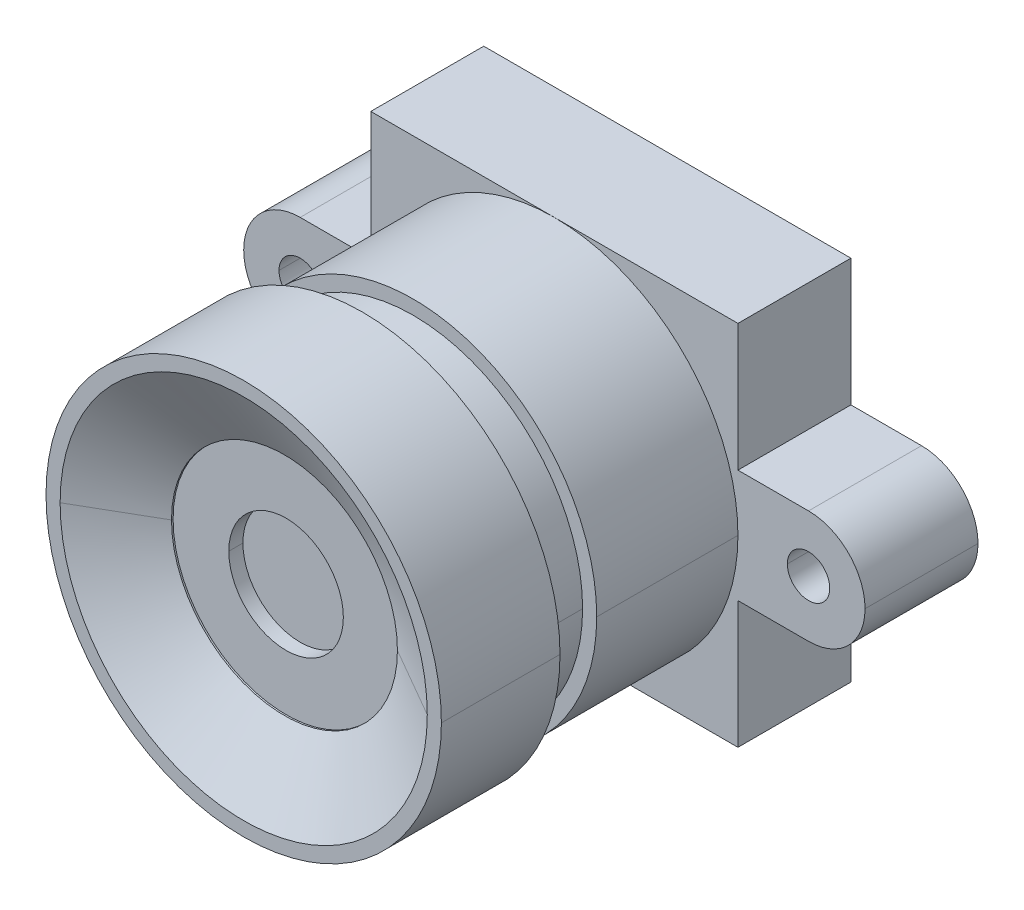
ISO-10303-21;
HEADER;
FILE_DESCRIPTION(('STEP AP214'),'2;1');
FILE_NAME('part.step','',(''),(''),'','','');
FILE_SCHEMA(('AUTOMOTIVE_DESIGN { 1 0 10303 214 1 1 1 1 }'));
ENDSEC;
DATA;
#1=APPLICATION_CONTEXT('core data for automotive mechanical design processes');
#2=APPLICATION_PROTOCOL_DEFINITION('international standard','automotive_design',2000,#1);
#3=PRODUCT_CONTEXT('',#1,'mechanical');
#4=PRODUCT('Part','Part','',(#3));
#5=PRODUCT_RELATED_PRODUCT_CATEGORY('part','',(#4));
#6=PRODUCT_DEFINITION_FORMATION('','',#4);
#7=PRODUCT_DEFINITION_CONTEXT('part definition',#1,'design');
#8=PRODUCT_DEFINITION('design','',#6,#7);
#9=PRODUCT_DEFINITION_SHAPE('','',#8);
#10=(LENGTH_UNIT() NAMED_UNIT(*) SI_UNIT(.MILLI.,.METRE.));
#11=(NAMED_UNIT(*) PLANE_ANGLE_UNIT() SI_UNIT($,.RADIAN.));
#12=(NAMED_UNIT(*) SI_UNIT($,.STERADIAN.) SOLID_ANGLE_UNIT());
#13=UNCERTAINTY_MEASURE_WITH_UNIT(LENGTH_MEASURE(1.E-05),#10,'distance_accuracy_value','');
#14=(GEOMETRIC_REPRESENTATION_CONTEXT(3) GLOBAL_UNCERTAINTY_ASSIGNED_CONTEXT((#13)) GLOBAL_UNIT_ASSIGNED_CONTEXT((#10,
#11,#12)) REPRESENTATION_CONTEXT('',''));
#15=CARTESIAN_POINT('',(0.,0.,0.));
#16=DIRECTION('',(0.,0.,1.));
#17=DIRECTION('',(1.,0.,0.));
#18=AXIS2_PLACEMENT_3D('',#15,#16,#17);
#19=CARTESIAN_POINT('',(0.,0.,13.));
#20=DIRECTION('',(0.,0.,1.));
#21=DIRECTION('',(1.,0.,0.));
#22=AXIS2_PLACEMENT_3D('',#19,#20,#21);
#23=PLANE('',#22);
#24=CARTESIAN_POINT('',(0.,0.,13.));
#25=DIRECTION('',(0.,0.,1.));
#26=DIRECTION('',(1.,0.,0.));
#27=AXIS2_PLACEMENT_3D('',#24,#25,#26);
#28=CIRCLE('',#27,2.02791290993503);
#29=CARTESIAN_POINT('',(2.02791290993503,0.,13.));
#30=VERTEX_POINT('',#29);
#31=CARTESIAN_POINT('',(-2.02791290993503,0.,13.));
#32=VERTEX_POINT('',#31);
#33=EDGE_CURVE('E11',#30,#32,#28,.T.);
#34=ORIENTED_EDGE('',*,*,#33,.T.);
#35=CARTESIAN_POINT('',(0.,0.,13.));
#36=DIRECTION('',(0.,0.,1.));
#37=DIRECTION('',(1.,0.,0.));
#38=AXIS2_PLACEMENT_3D('',#35,#36,#37);
#39=CIRCLE('',#38,2.02791290993503);
#40=EDGE_CURVE('E264',#32,#30,#39,.T.);
#41=ORIENTED_EDGE('',*,*,#40,.T.);
#42=EDGE_LOOP('',(#34,#41));
#43=FACE_BOUND('',#42,.T.);
#44=ADVANCED_FACE('F48',(#43),#23,.T.);
#45=CARTESIAN_POINT('',(0.,0.,13.));
#46=DIRECTION('',(0.,0.,1.));
#47=DIRECTION('',(1.,0.,0.));
#48=AXIS2_PLACEMENT_3D('',#45,#46,#47);
#49=CYLINDRICAL_SURFACE('',#48,2.02791290993503);
#50=DIRECTION('',(0.,0.,1.));
#51=VECTOR('',#50,1.);
#52=CARTESIAN_POINT('',(-2.02791290993503,0.,13.));
#53=LINE('',#52,#51);
#54=CARTESIAN_POINT('',(-2.02791290993503,0.,13.5));
#55=VERTEX_POINT('',#54);
#56=EDGE_CURVE('E268',#32,#55,#53,.T.);
#57=ORIENTED_EDGE('',*,*,#56,.F.);
#58=ORIENTED_EDGE('',*,*,#33,.F.);
#59=DIRECTION('',(0.,0.,1.));
#60=VECTOR('',#59,1.);
#61=CARTESIAN_POINT('',(2.02791290993503,0.,13.));
#62=LINE('',#61,#60);
#63=CARTESIAN_POINT('',(2.02791290993503,0.,13.5));
#64=VERTEX_POINT('',#63);
#65=EDGE_CURVE('E284',#30,#64,#62,.T.);
#66=ORIENTED_EDGE('',*,*,#65,.T.);
#67=CARTESIAN_POINT('',(0.,0.,13.5));
#68=DIRECTION('',(0.,0.,1.));
#69=DIRECTION('',(1.,0.,0.));
#70=AXIS2_PLACEMENT_3D('',#67,#68,#69);
#71=CIRCLE('',#70,2.02791290993503);
#72=EDGE_CURVE('E59',#64,#55,#71,.T.);
#73=ORIENTED_EDGE('',*,*,#72,.T.);
#74=EDGE_LOOP('',(#57,#58,#66,#73));
#75=FACE_BOUND('',#74,.T.);
#76=ADVANCED_FACE('F637',(#75),#49,.F.);
#77=CARTESIAN_POINT('',(0.,0.,13.5566243270259));
#78=DIRECTION('',(0.,0.,1.));
#79=DIRECTION('',(1.,0.,0.));
#80=AXIS2_PLACEMENT_3D('',#77,#78,#79);
#81=CONICAL_SURFACE('',#80,4.,1.0471975511966);
#82=DIRECTION('',(-0.86602540378444,0.,0.5));
#83=VECTOR('',#82,1.);
#84=CARTESIAN_POINT('',(-4.,0.,13.5566243270259));
#85=LINE('',#84,#83);
#86=CARTESIAN_POINT('',(-4.,0.,13.5566243270259));
#87=VERTEX_POINT('',#86);
#88=CARTESIAN_POINT('',(-6.5,0.,15.));
#89=VERTEX_POINT('',#88);
#90=EDGE_CURVE('E260',#87,#89,#85,.T.);
#91=ORIENTED_EDGE('',*,*,#90,.F.);
#92=CARTESIAN_POINT('',(0.,0.,13.5566243270259));
#93=DIRECTION('',(0.,0.,1.));
#94=DIRECTION('',(1.,0.,0.));
#95=AXIS2_PLACEMENT_3D('',#92,#93,#94);
#96=CIRCLE('',#95,4.);
#97=CARTESIAN_POINT('',(4.,0.,13.5566243270259));
#98=VERTEX_POINT('',#97);
#99=EDGE_CURVE('E412',#98,#87,#96,.T.);
#100=ORIENTED_EDGE('',*,*,#99,.F.);
#101=DIRECTION('',(0.86602540378444,0.,0.5));
#102=VECTOR('',#101,1.);
#103=CARTESIAN_POINT('',(4.,0.,13.5566243270259));
#104=LINE('',#103,#102);
#105=CARTESIAN_POINT('',(6.5,0.,15.));
#106=VERTEX_POINT('',#105);
#107=EDGE_CURVE('E232',#98,#106,#104,.T.);
#108=ORIENTED_EDGE('',*,*,#107,.T.);
#109=CARTESIAN_POINT('',(0.,0.,15.));
#110=DIRECTION('',(0.,0.,-1.));
#111=DIRECTION('',(1.,0.,0.));
#112=AXIS2_PLACEMENT_3D('',#109,#110,#111);
#113=CIRCLE('',#112,6.5);
#114=EDGE_CURVE('E299',#89,#106,#113,.T.);
#115=ORIENTED_EDGE('',*,*,#114,.F.);
#116=EDGE_LOOP('',(#91,#100,#108,#115));
#117=FACE_BOUND('',#116,.T.);
#118=ADVANCED_FACE('F616',(#117),#81,.F.);
#119=CARTESIAN_POINT('',(0.,0.,13.5));
#120=DIRECTION('',(0.,0.,1.));
#121=DIRECTION('',(1.,0.,0.));
#122=AXIS2_PLACEMENT_3D('',#119,#120,#121);
#123=PLANE('',#122);
#124=ORIENTED_EDGE('',*,*,#72,.F.);
#125=CARTESIAN_POINT('',(0.,0.,13.5));
#126=DIRECTION('',(0.,0.,1.));
#127=DIRECTION('',(1.,0.,0.));
#128=AXIS2_PLACEMENT_3D('',#125,#126,#127);
#129=CIRCLE('',#128,2.02791290993503);
#130=EDGE_CURVE('E289',#55,#64,#129,.T.);
#131=ORIENTED_EDGE('',*,*,#130,.F.);
#132=EDGE_LOOP('',(#124,#131));
#133=FACE_BOUND('',#132,.T.);
#134=CARTESIAN_POINT('',(0.,0.,13.5));
#135=DIRECTION('',(0.,0.,1.));
#136=DIRECTION('',(1.,0.,0.));
#137=AXIS2_PLACEMENT_3D('',#134,#135,#136);
#138=CIRCLE('',#137,4.);
#139=CARTESIAN_POINT('',(4.,0.,13.5));
#140=VERTEX_POINT('',#139);
#141=CARTESIAN_POINT('',(-4.,0.,13.5));
#142=VERTEX_POINT('',#141);
#143=EDGE_CURVE('E303',#140,#142,#138,.T.);
#144=ORIENTED_EDGE('',*,*,#143,.T.);
#145=CARTESIAN_POINT('',(0.,0.,13.5));
#146=DIRECTION('',(0.,0.,1.));
#147=DIRECTION('',(1.,0.,0.));
#148=AXIS2_PLACEMENT_3D('',#145,#146,#147);
#149=CIRCLE('',#148,4.);
#150=EDGE_CURVE('E236',#142,#140,#149,.T.);
#151=ORIENTED_EDGE('',*,*,#150,.T.);
#152=EDGE_LOOP('',(#144,#151));
#153=FACE_BOUND('',#152,.T.);
#154=ADVANCED_FACE('F627',(#133,#153),#123,.T.);
#155=CARTESIAN_POINT('',(0.,0.,13.5));
#156=DIRECTION('',(0.,0.,1.));
#157=DIRECTION('',(1.,0.,0.));
#158=AXIS2_PLACEMENT_3D('',#155,#156,#157);
#159=CYLINDRICAL_SURFACE('',#158,4.);
#160=DIRECTION('',(0.,0.,1.));
#161=VECTOR('',#160,1.);
#162=CARTESIAN_POINT('',(-4.,0.,13.5));
#163=LINE('',#162,#161);
#164=EDGE_CURVE('E192',#142,#87,#163,.T.);
#165=ORIENTED_EDGE('',*,*,#164,.F.);
#166=ORIENTED_EDGE('',*,*,#143,.F.);
#167=DIRECTION('',(0.,0.,1.));
#168=VECTOR('',#167,1.);
#169=CARTESIAN_POINT('',(4.,0.,13.5));
#170=LINE('',#169,#168);
#171=EDGE_CURVE('E183',#140,#98,#170,.T.);
#172=ORIENTED_EDGE('',*,*,#171,.T.);
#173=ORIENTED_EDGE('',*,*,#99,.T.);
#174=EDGE_LOOP('',(#165,#166,#172,#173));
#175=FACE_BOUND('',#174,.T.);
#176=ADVANCED_FACE('F621',(#175),#159,.F.);
#177=CARTESIAN_POINT('',(0.,0.,15.));
#178=DIRECTION('',(0.,0.,1.));
#179=DIRECTION('',(1.,0.,0.));
#180=AXIS2_PLACEMENT_3D('',#177,#178,#179);
#181=PLANE('',#180);
#182=CARTESIAN_POINT('',(0.,0.,15.));
#183=DIRECTION('',(0.,0.,-1.));
#184=DIRECTION('',(1.,0.,0.));
#185=AXIS2_PLACEMENT_3D('',#182,#183,#184);
#186=CIRCLE('',#185,6.5);
#187=EDGE_CURVE('E237',#106,#89,#186,.T.);
#188=ORIENTED_EDGE('',*,*,#187,.T.);
#189=ORIENTED_EDGE('',*,*,#114,.T.);
#190=EDGE_LOOP('',(#188,#189));
#191=FACE_BOUND('',#190,.T.);
#192=CARTESIAN_POINT('',(0.,0.,15.));
#193=DIRECTION('',(0.,0.,1.));
#194=DIRECTION('',(1.,0.,0.));
#195=AXIS2_PLACEMENT_3D('',#192,#193,#194);
#196=CIRCLE('',#195,7.);
#197=CARTESIAN_POINT('',(7.,0.,15.));
#198=VERTEX_POINT('',#197);
#199=CARTESIAN_POINT('',(-7.,0.,15.));
#200=VERTEX_POINT('',#199);
#201=EDGE_CURVE('E177',#198,#200,#196,.T.);
#202=ORIENTED_EDGE('',*,*,#201,.T.);
#203=CARTESIAN_POINT('',(0.,0.,15.));
#204=DIRECTION('',(0.,0.,1.));
#205=DIRECTION('',(1.,0.,0.));
#206=AXIS2_PLACEMENT_3D('',#203,#204,#205);
#207=CIRCLE('',#206,7.);
#208=EDGE_CURVE('E170',#200,#198,#207,.T.);
#209=ORIENTED_EDGE('',*,*,#208,.T.);
#210=EDGE_LOOP('',(#202,#209));
#211=FACE_BOUND('',#210,.T.);
#212=ADVANCED_FACE('F635',(#191,#211),#181,.T.);
#213=CARTESIAN_POINT('',(0.,0.,10.8));
#214=DIRECTION('',(0.,0.,1.));
#215=DIRECTION('',(1.,0.,0.));
#216=AXIS2_PLACEMENT_3D('',#213,#214,#215);
#217=PLANE('',#216);
#218=CARTESIAN_POINT('',(0.,0.,10.8));
#219=DIRECTION('',(0.,0.,1.));
#220=DIRECTION('',(1.,0.,0.));
#221=AXIS2_PLACEMENT_3D('',#218,#219,#220);
#222=CIRCLE('',#221,6.);
#223=CARTESIAN_POINT('',(-6.,0.,10.8));
#224=VERTEX_POINT('',#223);
#225=CARTESIAN_POINT('',(6.,0.,10.8));
#226=VERTEX_POINT('',#225);
#227=EDGE_CURVE('E290',#224,#226,#222,.T.);
#228=ORIENTED_EDGE('',*,*,#227,.T.);
#229=CARTESIAN_POINT('',(0.,0.,10.8));
#230=DIRECTION('',(0.,0.,1.));
#231=DIRECTION('',(1.,0.,0.));
#232=AXIS2_PLACEMENT_3D('',#229,#230,#231);
#233=CIRCLE('',#232,6.);
#234=EDGE_CURVE('E274',#226,#224,#233,.T.);
#235=ORIENTED_EDGE('',*,*,#234,.T.);
#236=EDGE_LOOP('',(#228,#235));
#237=FACE_BOUND('',#236,.T.);
#238=CARTESIAN_POINT('',(0.,0.,10.8));
#239=DIRECTION('',(0.,0.,1.));
#240=DIRECTION('',(1.,0.,0.));
#241=AXIS2_PLACEMENT_3D('',#238,#239,#240);
#242=CIRCLE('',#241,7.);
#243=CARTESIAN_POINT('',(7.,0.,10.8));
#244=VERTEX_POINT('',#243);
#245=CARTESIAN_POINT('',(-7.,0.,10.8));
#246=VERTEX_POINT('',#245);
#247=EDGE_CURVE('E175',#244,#246,#242,.T.);
#248=ORIENTED_EDGE('',*,*,#247,.F.);
#249=CARTESIAN_POINT('',(0.,0.,10.8));
#250=DIRECTION('',(0.,0.,1.));
#251=DIRECTION('',(1.,0.,0.));
#252=AXIS2_PLACEMENT_3D('',#249,#250,#251);
#253=CIRCLE('',#252,7.);
#254=EDGE_CURVE('E153',#246,#244,#253,.T.);
#255=ORIENTED_EDGE('',*,*,#254,.F.);
#256=EDGE_LOOP('',(#248,#255));
#257=FACE_BOUND('',#256,.T.);
#258=ADVANCED_FACE('F181',(#237,#257),#217,.F.);
#259=CARTESIAN_POINT('',(0.,0.,10.8));
#260=DIRECTION('',(0.,0.,1.));
#261=DIRECTION('',(1.,0.,0.));
#262=AXIS2_PLACEMENT_3D('',#259,#260,#261);
#263=CYLINDRICAL_SURFACE('',#262,7.);
#264=DIRECTION('',(0.,0.,1.));
#265=VECTOR('',#264,1.);
#266=CARTESIAN_POINT('',(-7.,0.,10.8));
#267=LINE('',#266,#265);
#268=EDGE_CURVE('E167',#246,#200,#267,.T.);
#269=ORIENTED_EDGE('',*,*,#268,.F.);
#270=ORIENTED_EDGE('',*,*,#254,.T.);
#271=DIRECTION('',(0.,0.,1.));
#272=VECTOR('',#271,1.);
#273=CARTESIAN_POINT('',(7.,0.,10.8));
#274=LINE('',#273,#272);
#275=EDGE_CURVE('E164',#244,#198,#274,.T.);
#276=ORIENTED_EDGE('',*,*,#275,.T.);
#277=ORIENTED_EDGE('',*,*,#208,.F.);
#278=EDGE_LOOP('',(#269,#270,#276,#277));
#279=FACE_BOUND('',#278,.T.);
#280=ADVANCED_FACE('F163',(#279),#263,.T.);
#281=CARTESIAN_POINT('',(0.,0.,9.));
#282=DIRECTION('',(0.,0.,1.));
#283=DIRECTION('',(1.,0.,0.));
#284=AXIS2_PLACEMENT_3D('',#281,#282,#283);
#285=PLANE('',#284);
#286=CARTESIAN_POINT('',(0.,0.,9.));
#287=DIRECTION('',(0.,0.,1.));
#288=DIRECTION('',(1.,0.,0.));
#289=AXIS2_PLACEMENT_3D('',#286,#287,#288);
#290=CIRCLE('',#289,6.);
#291=CARTESIAN_POINT('',(-6.,0.,9.));
#292=VERTEX_POINT('',#291);
#293=CARTESIAN_POINT('',(6.,0.,9.));
#294=VERTEX_POINT('',#293);
#295=EDGE_CURVE('E294',#292,#294,#290,.T.);
#296=ORIENTED_EDGE('',*,*,#295,.F.);
#297=CARTESIAN_POINT('',(0.,0.,9.));
#298=DIRECTION('',(0.,0.,1.));
#299=DIRECTION('',(1.,0.,0.));
#300=AXIS2_PLACEMENT_3D('',#297,#298,#299);
#301=CIRCLE('',#300,6.);
#302=EDGE_CURVE('E273',#294,#292,#301,.T.);
#303=ORIENTED_EDGE('',*,*,#302,.F.);
#304=EDGE_LOOP('',(#296,#303));
#305=FACE_BOUND('',#304,.T.);
#306=CARTESIAN_POINT('',(0.,0.,9.));
#307=DIRECTION('',(0.,0.,1.));
#308=DIRECTION('',(1.,0.,0.));
#309=AXIS2_PLACEMENT_3D('',#306,#307,#308);
#310=CIRCLE('',#309,6.5);
#311=CARTESIAN_POINT('',(-6.5,0.,9.));
#312=VERTEX_POINT('',#311);
#313=CARTESIAN_POINT('',(6.5,0.,9.));
#314=VERTEX_POINT('',#313);
#315=EDGE_CURVE('E171',#312,#314,#310,.T.);
#316=ORIENTED_EDGE('',*,*,#315,.T.);
#317=CARTESIAN_POINT('',(0.,0.,9.));
#318=DIRECTION('',(0.,0.,1.));
#319=DIRECTION('',(1.,0.,0.));
#320=AXIS2_PLACEMENT_3D('',#317,#318,#319);
#321=CIRCLE('',#320,6.5);
#322=EDGE_CURVE('E179',#314,#312,#321,.T.);
#323=ORIENTED_EDGE('',*,*,#322,.T.);
#324=EDGE_LOOP('',(#316,#323));
#325=FACE_BOUND('',#324,.T.);
#326=ADVANCED_FACE('F694',(#305,#325),#285,.T.);
#327=CARTESIAN_POINT('',(0.,0.,9.));
#328=DIRECTION('',(0.,0.,-1.));
#329=DIRECTION('',(-1.,0.,0.));
#330=AXIS2_PLACEMENT_3D('',#327,#328,#329);
#331=CYLINDRICAL_SURFACE('',#330,6.5);
#332=DIRECTION('',(0.,0.,-1.));
#333=VECTOR('',#332,1.);
#334=CARTESIAN_POINT('',(6.5,0.,9.));
#335=LINE('',#334,#333);
#336=CARTESIAN_POINT('',(6.5,0.,4.));
#337=VERTEX_POINT('',#336);
#338=EDGE_CURVE('E355',#314,#337,#335,.T.);
#339=ORIENTED_EDGE('',*,*,#338,.F.);
#340=ORIENTED_EDGE('',*,*,#315,.F.);
#341=DIRECTION('',(0.,0.,-1.));
#342=VECTOR('',#341,1.);
#343=CARTESIAN_POINT('',(-6.5,0.,9.));
#344=LINE('',#343,#342);
#345=CARTESIAN_POINT('',(-6.5,0.,4.));
#346=VERTEX_POINT('',#345);
#347=EDGE_CURVE('E283',#312,#346,#344,.T.);
#348=ORIENTED_EDGE('',*,*,#347,.T.);
#349=CARTESIAN_POINT('',(0.,0.,4.));
#350=DIRECTION('',(0.,0.,1.));
#351=DIRECTION('',(1.,0.,0.));
#352=AXIS2_PLACEMENT_3D('',#349,#350,#351);
#353=CIRCLE('',#352,6.5);
#354=CARTESIAN_POINT('',(0.,-6.5,4.));
#355=VERTEX_POINT('',#354);
#356=EDGE_CURVE('E256',#346,#355,#353,.T.);
#357=ORIENTED_EDGE('',*,*,#356,.T.);
#358=CARTESIAN_POINT('',(0.,0.,4.));
#359=DIRECTION('',(0.,0.,1.));
#360=DIRECTION('',(1.,0.,0.));
#361=AXIS2_PLACEMENT_3D('',#358,#359,#360);
#362=CIRCLE('',#361,6.5);
#363=EDGE_CURVE('E317',#355,#337,#362,.T.);
#364=ORIENTED_EDGE('',*,*,#363,.T.);
#365=EDGE_LOOP('',(#339,#340,#348,#357,#364));
#366=FACE_BOUND('',#365,.T.);
#367=ADVANCED_FACE('F710',(#366),#331,.T.);
#368=CARTESIAN_POINT('',(6.5,-6.5,4.));
#369=DIRECTION('',(0.,1.,0.));
#370=DIRECTION('',(1.,0.,0.));
#371=AXIS2_PLACEMENT_3D('',#368,#369,#370);
#372=PLANE('',#371);
#373=DIRECTION('',(1.,0.,0.));
#374=VECTOR('',#373,1.);
#375=CARTESIAN_POINT('',(6.5,-6.5,0.));
#376=LINE('',#375,#374);
#377=CARTESIAN_POINT('',(-6.5,-6.5,0.));
#378=VERTEX_POINT('',#377);
#379=CARTESIAN_POINT('',(6.5,-6.5,0.));
#380=VERTEX_POINT('',#379);
#381=EDGE_CURVE('E346',#378,#380,#376,.T.);
#382=ORIENTED_EDGE('',*,*,#381,.T.);
#383=DIRECTION('',(0.,0.,-1.));
#384=VECTOR('',#383,1.);
#385=CARTESIAN_POINT('',(6.5,-6.5,4.));
#386=LINE('',#385,#384);
#387=CARTESIAN_POINT('',(6.5,-6.5,4.));
#388=VERTEX_POINT('',#387);
#389=EDGE_CURVE('E377',#388,#380,#386,.T.);
#390=ORIENTED_EDGE('',*,*,#389,.F.);
#391=DIRECTION('',(1.,0.,0.));
#392=VECTOR('',#391,1.);
#393=CARTESIAN_POINT('',(6.5,-6.5,4.));
#394=LINE('',#393,#392);
#395=EDGE_CURVE('E402',#355,#388,#394,.T.);
#396=ORIENTED_EDGE('',*,*,#395,.F.);
#397=DIRECTION('',(1.,0.,0.));
#398=VECTOR('',#397,1.);
#399=CARTESIAN_POINT('',(6.5,-6.5,4.));
#400=LINE('',#399,#398);
#401=CARTESIAN_POINT('',(-6.5,-6.5,4.));
#402=VERTEX_POINT('',#401);
#403=EDGE_CURVE('E345',#402,#355,#400,.T.);
#404=ORIENTED_EDGE('',*,*,#403,.F.);
#405=DIRECTION('',(0.,0.,-1.));
#406=VECTOR('',#405,1.);
#407=CARTESIAN_POINT('',(-6.5,-6.5,4.));
#408=LINE('',#407,#406);
#409=EDGE_CURVE('E398',#402,#378,#408,.T.);
#410=ORIENTED_EDGE('',*,*,#409,.T.);
#411=EDGE_LOOP('',(#382,#390,#396,#404,#410));
#412=FACE_BOUND('',#411,.T.);
#413=ADVANCED_FACE('F651',(#412),#372,.F.);
#414=CARTESIAN_POINT('',(6.5,-6.5,4.));
#415=DIRECTION('',(-1.,0.,0.));
#416=DIRECTION('',(0.,0.,1.));
#417=AXIS2_PLACEMENT_3D('',#414,#415,#416);
#418=PLANE('',#417);
#419=DIRECTION('',(0.,0.,-1.));
#420=VECTOR('',#419,1.);
#421=CARTESIAN_POINT('',(6.5,-2.,0.));
#422=LINE('',#421,#420);
#423=CARTESIAN_POINT('',(6.5,-2.,4.));
#424=VERTEX_POINT('',#423);
#425=CARTESIAN_POINT('',(6.5,-2.,0.));
#426=VERTEX_POINT('',#425);
#427=EDGE_CURVE('E214',#424,#426,#422,.T.);
#428=ORIENTED_EDGE('',*,*,#427,.F.);
#429=DIRECTION('',(0.,1.,0.));
#430=VECTOR('',#429,1.);
#431=CARTESIAN_POINT('',(6.5,-6.5,4.));
#432=LINE('',#431,#430);
#433=EDGE_CURVE('E196',#388,#424,#432,.T.);
#434=ORIENTED_EDGE('',*,*,#433,.F.);
#435=ORIENTED_EDGE('',*,*,#389,.T.);
#436=DIRECTION('',(0.,1.,0.));
#437=VECTOR('',#436,1.);
#438=CARTESIAN_POINT('',(6.5,-6.5,0.));
#439=LINE('',#438,#437);
#440=EDGE_CURVE('E351',#380,#426,#439,.T.);
#441=ORIENTED_EDGE('',*,*,#440,.T.);
#442=EDGE_LOOP('',(#428,#434,#435,#441));
#443=FACE_BOUND('',#442,.T.);
#444=ADVANCED_FACE('F704',(#443),#418,.F.);
#445=CARTESIAN_POINT('',(-6.5,-6.5,4.));
#446=DIRECTION('',(1.,0.,0.));
#447=DIRECTION('',(0.,1.,0.));
#448=AXIS2_PLACEMENT_3D('',#445,#446,#447);
#449=PLANE('',#448);
#450=DIRECTION('',(0.,0.,1.));
#451=VECTOR('',#450,1.);
#452=CARTESIAN_POINT('',(-6.5,-2.,0.));
#453=LINE('',#452,#451);
#454=CARTESIAN_POINT('',(-6.5,-2.,0.));
#455=VERTEX_POINT('',#454);
#456=CARTESIAN_POINT('',(-6.5,-2.,4.));
#457=VERTEX_POINT('',#456);
#458=EDGE_CURVE('E350',#455,#457,#453,.T.);
#459=ORIENTED_EDGE('',*,*,#458,.F.);
#460=DIRECTION('',(0.,-1.,0.));
#461=VECTOR('',#460,1.);
#462=CARTESIAN_POINT('',(-6.5,-6.5,0.));
#463=LINE('',#462,#461);
#464=EDGE_CURVE('E255',#455,#378,#463,.T.);
#465=ORIENTED_EDGE('',*,*,#464,.T.);
#466=ORIENTED_EDGE('',*,*,#409,.F.);
#467=DIRECTION('',(0.,-1.,0.));
#468=VECTOR('',#467,1.);
#469=CARTESIAN_POINT('',(-6.5,-6.5,4.));
#470=LINE('',#469,#468);
#471=EDGE_CURVE('E341',#457,#402,#470,.T.);
#472=ORIENTED_EDGE('',*,*,#471,.F.);
#473=EDGE_LOOP('',(#459,#465,#466,#472));
#474=FACE_BOUND('',#473,.T.);
#475=ADVANCED_FACE('F687',(#474),#449,.F.);
#476=CARTESIAN_POINT('',(6.5,6.5,4.));
#477=DIRECTION('',(0.,-1.,0.));
#478=DIRECTION('',(0.,0.,-1.));
#479=AXIS2_PLACEMENT_3D('',#476,#477,#478);
#480=PLANE('',#479);
#481=DIRECTION('',(-1.,0.,0.));
#482=VECTOR('',#481,1.);
#483=CARTESIAN_POINT('',(6.5,6.5,0.));
#484=LINE('',#483,#482);
#485=CARTESIAN_POINT('',(6.5,6.5,0.));
#486=VERTEX_POINT('',#485);
#487=CARTESIAN_POINT('',(-6.5,6.5,0.));
#488=VERTEX_POINT('',#487);
#489=EDGE_CURVE('E433',#486,#488,#484,.T.);
#490=ORIENTED_EDGE('',*,*,#489,.T.);
#491=DIRECTION('',(0.,0.,-1.));
#492=VECTOR('',#491,1.);
#493=CARTESIAN_POINT('',(-6.5,6.5,4.));
#494=LINE('',#493,#492);
#495=CARTESIAN_POINT('',(-6.5,6.5,4.));
#496=VERTEX_POINT('',#495);
#497=EDGE_CURVE('E385',#496,#488,#494,.T.);
#498=ORIENTED_EDGE('',*,*,#497,.F.);
#499=DIRECTION('',(-1.,0.,0.));
#500=VECTOR('',#499,1.);
#501=CARTESIAN_POINT('',(6.5,6.5,4.));
#502=LINE('',#501,#500);
#503=CARTESIAN_POINT('',(0.,6.5,4.));
#504=VERTEX_POINT('',#503);
#505=EDGE_CURVE('E308',#504,#496,#502,.T.);
#506=ORIENTED_EDGE('',*,*,#505,.F.);
#507=DIRECTION('',(-1.,0.,0.));
#508=VECTOR('',#507,1.);
#509=CARTESIAN_POINT('',(6.5,6.5,4.));
#510=LINE('',#509,#508);
#511=CARTESIAN_POINT('',(6.5,6.5,4.));
#512=VERTEX_POINT('',#511);
#513=EDGE_CURVE('E207',#512,#504,#510,.T.);
#514=ORIENTED_EDGE('',*,*,#513,.F.);
#515=DIRECTION('',(0.,0.,-1.));
#516=VECTOR('',#515,1.);
#517=CARTESIAN_POINT('',(6.5,6.5,4.));
#518=LINE('',#517,#516);
#519=EDGE_CURVE('E72',#512,#486,#518,.T.);
#520=ORIENTED_EDGE('',*,*,#519,.T.);
#521=EDGE_LOOP('',(#490,#498,#506,#514,#520));
#522=FACE_BOUND('',#521,.T.);
#523=ADVANCED_FACE('F683',(#522),#480,.F.);
#524=CARTESIAN_POINT('',(-6.5,-6.5,4.));
#525=DIRECTION('',(1.,0.,0.));
#526=DIRECTION('',(0.,1.,0.));
#527=AXIS2_PLACEMENT_3D('',#524,#525,#526);
#528=PLANE('',#527);
#529=DIRECTION('',(0.,0.,-1.));
#530=VECTOR('',#529,1.);
#531=CARTESIAN_POINT('',(-6.5,2.,0.));
#532=LINE('',#531,#530);
#533=CARTESIAN_POINT('',(-6.5,2.,4.));
#534=VERTEX_POINT('',#533);
#535=CARTESIAN_POINT('',(-6.5,2.,0.));
#536=VERTEX_POINT('',#535);
#537=EDGE_CURVE('E218',#534,#536,#532,.T.);
#538=ORIENTED_EDGE('',*,*,#537,.F.);
#539=DIRECTION('',(0.,-1.,0.));
#540=VECTOR('',#539,1.);
#541=CARTESIAN_POINT('',(-6.5,-6.5,4.));
#542=LINE('',#541,#540);
#543=EDGE_CURVE('E312',#496,#534,#542,.T.);
#544=ORIENTED_EDGE('',*,*,#543,.F.);
#545=ORIENTED_EDGE('',*,*,#497,.T.);
#546=DIRECTION('',(0.,-1.,0.));
#547=VECTOR('',#546,1.);
#548=CARTESIAN_POINT('',(-6.5,-6.5,0.));
#549=LINE('',#548,#547);
#550=EDGE_CURVE('E471',#488,#536,#549,.T.);
#551=ORIENTED_EDGE('',*,*,#550,.T.);
#552=EDGE_LOOP('',(#538,#544,#545,#551));
#553=FACE_BOUND('',#552,.T.);
#554=ADVANCED_FACE('F686',(#553),#528,.F.);
#555=CARTESIAN_POINT('',(6.5,-6.5,4.));
#556=DIRECTION('',(-1.,0.,0.));
#557=DIRECTION('',(0.,0.,1.));
#558=AXIS2_PLACEMENT_3D('',#555,#556,#557);
#559=PLANE('',#558);
#560=DIRECTION('',(0.,0.,1.));
#561=VECTOR('',#560,1.);
#562=CARTESIAN_POINT('',(6.5,2.,0.));
#563=LINE('',#562,#561);
#564=CARTESIAN_POINT('',(6.5,2.,0.));
#565=VERTEX_POINT('',#564);
#566=CARTESIAN_POINT('',(6.5,2.,4.));
#567=VERTEX_POINT('',#566);
#568=EDGE_CURVE('E202',#565,#567,#563,.T.);
#569=ORIENTED_EDGE('',*,*,#568,.F.);
#570=DIRECTION('',(0.,1.,0.));
#571=VECTOR('',#570,1.);
#572=CARTESIAN_POINT('',(6.5,-6.5,0.));
#573=LINE('',#572,#571);
#574=EDGE_CURVE('E420',#565,#486,#573,.T.);
#575=ORIENTED_EDGE('',*,*,#574,.T.);
#576=ORIENTED_EDGE('',*,*,#519,.F.);
#577=DIRECTION('',(0.,1.,0.));
#578=VECTOR('',#577,1.);
#579=CARTESIAN_POINT('',(6.5,-6.5,4.));
#580=LINE('',#579,#578);
#581=EDGE_CURVE('E203',#567,#512,#580,.T.);
#582=ORIENTED_EDGE('',*,*,#581,.F.);
#583=EDGE_LOOP('',(#569,#575,#576,#582));
#584=FACE_BOUND('',#583,.T.);
#585=ADVANCED_FACE('F662',(#584),#559,.F.);
#586=CARTESIAN_POINT('',(-9.,0.,0.));
#587=DIRECTION('',(0.,0.,1.));
#588=DIRECTION('',(1.,0.,0.));
#589=AXIS2_PLACEMENT_3D('',#586,#587,#588);
#590=CYLINDRICAL_SURFACE('',#589,0.75);
#591=DIRECTION('',(0.,0.,1.));
#592=VECTOR('',#591,1.);
#593=CARTESIAN_POINT('',(-9.75,0.,0.));
#594=LINE('',#593,#592);
#595=CARTESIAN_POINT('',(-9.75,0.,0.));
#596=VERTEX_POINT('',#595);
#597=CARTESIAN_POINT('',(-9.75,0.,4.));
#598=VERTEX_POINT('',#597);
#599=EDGE_CURVE('E282',#596,#598,#594,.T.);
#600=ORIENTED_EDGE('',*,*,#599,.F.);
#601=CARTESIAN_POINT('',(-9.,0.,0.));
#602=DIRECTION('',(0.,0.,-1.));
#603=DIRECTION('',(-1.,0.,0.));
#604=AXIS2_PLACEMENT_3D('',#601,#602,#603);
#605=CIRCLE('',#604,0.75);
#606=CARTESIAN_POINT('',(-8.25,0.,0.));
#607=VERTEX_POINT('',#606);
#608=EDGE_CURVE('E242',#596,#607,#605,.T.);
#609=ORIENTED_EDGE('',*,*,#608,.T.);
#610=DIRECTION('',(0.,0.,1.));
#611=VECTOR('',#610,1.);
#612=CARTESIAN_POINT('',(-8.25,0.,0.));
#613=LINE('',#612,#611);
#614=CARTESIAN_POINT('',(-8.25,0.,4.));
#615=VERTEX_POINT('',#614);
#616=EDGE_CURVE('E336',#607,#615,#613,.T.);
#617=ORIENTED_EDGE('',*,*,#616,.T.);
#618=CARTESIAN_POINT('',(-9.,0.,4.));
#619=DIRECTION('',(0.,0.,1.));
#620=DIRECTION('',(1.,0.,0.));
#621=AXIS2_PLACEMENT_3D('',#618,#619,#620);
#622=CIRCLE('',#621,0.75);
#623=EDGE_CURVE('E251',#615,#598,#622,.T.);
#624=ORIENTED_EDGE('',*,*,#623,.T.);
#625=EDGE_LOOP('',(#600,#609,#617,#624));
#626=FACE_BOUND('',#625,.T.);
#627=ADVANCED_FACE('F658',(#626),#590,.F.);
#628=CARTESIAN_POINT('',(9.,0.,0.));
#629=DIRECTION('',(0.,0.,1.));
#630=DIRECTION('',(1.,0.,0.));
#631=AXIS2_PLACEMENT_3D('',#628,#629,#630);
#632=CYLINDRICAL_SURFACE('',#631,0.75);
#633=DIRECTION('',(0.,0.,1.));
#634=VECTOR('',#633,1.);
#635=CARTESIAN_POINT('',(8.25,0.,0.));
#636=LINE('',#635,#634);
#637=CARTESIAN_POINT('',(8.25,0.,0.));
#638=VERTEX_POINT('',#637);
#639=CARTESIAN_POINT('',(8.25,0.,4.));
#640=VERTEX_POINT('',#639);
#641=EDGE_CURVE('E231',#638,#640,#636,.T.);
#642=ORIENTED_EDGE('',*,*,#641,.F.);
#643=CARTESIAN_POINT('',(9.,0.,0.));
#644=DIRECTION('',(0.,0.,-1.));
#645=DIRECTION('',(-1.,0.,0.));
#646=AXIS2_PLACEMENT_3D('',#643,#644,#645);
#647=CIRCLE('',#646,0.75);
#648=CARTESIAN_POINT('',(9.75,0.,0.));
#649=VERTEX_POINT('',#648);
#650=EDGE_CURVE('E238',#638,#649,#647,.T.);
#651=ORIENTED_EDGE('',*,*,#650,.T.);
#652=DIRECTION('',(0.,0.,1.));
#653=VECTOR('',#652,1.);
#654=CARTESIAN_POINT('',(9.75,0.,0.));
#655=LINE('',#654,#653);
#656=CARTESIAN_POINT('',(9.75,0.,4.));
#657=VERTEX_POINT('',#656);
#658=EDGE_CURVE('E230',#649,#657,#655,.T.);
#659=ORIENTED_EDGE('',*,*,#658,.T.);
#660=CARTESIAN_POINT('',(9.,0.,4.));
#661=DIRECTION('',(0.,0.,1.));
#662=DIRECTION('',(1.,0.,0.));
#663=AXIS2_PLACEMENT_3D('',#660,#661,#662);
#664=CIRCLE('',#663,0.75);
#665=EDGE_CURVE('E243',#657,#640,#664,.T.);
#666=ORIENTED_EDGE('',*,*,#665,.T.);
#667=EDGE_LOOP('',(#642,#651,#659,#666));
#668=FACE_BOUND('',#667,.T.);
#669=ADVANCED_FACE('F661',(#668),#632,.F.);
#670=CARTESIAN_POINT('',(9.,0.,4.));
#671=DIRECTION('',(0.,0.,1.));
#672=DIRECTION('',(1.,0.,0.));
#673=AXIS2_PLACEMENT_3D('',#670,#671,#672);
#674=PLANE('',#673);
#675=ORIENTED_EDGE('',*,*,#665,.F.);
#676=CARTESIAN_POINT('',(9.,0.,4.));
#677=DIRECTION('',(0.,0.,1.));
#678=DIRECTION('',(1.,0.,0.));
#679=AXIS2_PLACEMENT_3D('',#676,#677,#678);
#680=CIRCLE('',#679,0.75);
#681=EDGE_CURVE('E226',#640,#657,#680,.T.);
#682=ORIENTED_EDGE('',*,*,#681,.F.);
#683=EDGE_LOOP('',(#675,#682));
#684=FACE_BOUND('',#683,.T.);
#685=ORIENTED_EDGE('',*,*,#363,.F.);
#686=ORIENTED_EDGE('',*,*,#395,.T.);
#687=ORIENTED_EDGE('',*,*,#433,.T.);
#688=DIRECTION('',(1.,0.,0.));
#689=VECTOR('',#688,1.);
#690=CARTESIAN_POINT('',(9.,-2.,4.));
#691=LINE('',#690,#689);
#692=CARTESIAN_POINT('',(9.,-2.,4.));
#693=VERTEX_POINT('',#692);
#694=EDGE_CURVE('E219',#424,#693,#691,.T.);
#695=ORIENTED_EDGE('',*,*,#694,.T.);
#696=CARTESIAN_POINT('',(9.,0.,4.));
#697=DIRECTION('',(0.,0.,1.));
#698=DIRECTION('',(1.,0.,0.));
#699=AXIS2_PLACEMENT_3D('',#696,#697,#698);
#700=CIRCLE('',#699,2.);
#701=CARTESIAN_POINT('',(11.,0.,4.));
#702=VERTEX_POINT('',#701);
#703=EDGE_CURVE('E211',#693,#702,#700,.T.);
#704=ORIENTED_EDGE('',*,*,#703,.T.);
#705=CARTESIAN_POINT('',(9.,0.,4.));
#706=DIRECTION('',(0.,0.,1.));
#707=DIRECTION('',(1.,0.,0.));
#708=AXIS2_PLACEMENT_3D('',#705,#706,#707);
#709=CIRCLE('',#708,2.);
#710=CARTESIAN_POINT('',(9.,2.,4.));
#711=VERTEX_POINT('',#710);
#712=EDGE_CURVE('E313',#702,#711,#709,.T.);
#713=ORIENTED_EDGE('',*,*,#712,.T.);
#714=DIRECTION('',(-1.,0.,0.));
#715=VECTOR('',#714,1.);
#716=CARTESIAN_POINT('',(9.,2.,4.));
#717=LINE('',#716,#715);
#718=EDGE_CURVE('E198',#711,#567,#717,.T.);
#719=ORIENTED_EDGE('',*,*,#718,.T.);
#720=ORIENTED_EDGE('',*,*,#581,.T.);
#721=ORIENTED_EDGE('',*,*,#513,.T.);
#722=CARTESIAN_POINT('',(0.,0.,4.));
#723=DIRECTION('',(0.,0.,1.));
#724=DIRECTION('',(1.,0.,0.));
#725=AXIS2_PLACEMENT_3D('',#722,#723,#724);
#726=CIRCLE('',#725,6.5);
#727=EDGE_CURVE('E328',#337,#504,#726,.T.);
#728=ORIENTED_EDGE('',*,*,#727,.F.);
#729=EDGE_LOOP('',(#685,#686,#687,#695,#704,#713,#719,#720,#721,#728));
#730=FACE_BOUND('',#729,.T.);
#731=ADVANCED_FACE('F670',(#684,#730),#674,.T.);
#732=CARTESIAN_POINT('',(-9.,0.,0.));
#733=DIRECTION('',(0.,0.,1.));
#734=DIRECTION('',(1.,0.,0.));
#735=AXIS2_PLACEMENT_3D('',#732,#733,#734);
#736=CYLINDRICAL_SURFACE('',#735,2.);
#737=CARTESIAN_POINT('',(-9.,0.,4.));
#738=DIRECTION('',(0.,0.,1.));
#739=DIRECTION('',(1.,0.,0.));
#740=AXIS2_PLACEMENT_3D('',#737,#738,#739);
#741=CIRCLE('',#740,2.);
#742=CARTESIAN_POINT('',(-9.,2.,4.));
#743=VERTEX_POINT('',#742);
#744=CARTESIAN_POINT('',(-9.,-2.,4.));
#745=VERTEX_POINT('',#744);
#746=EDGE_CURVE('E220',#743,#745,#741,.T.);
#747=ORIENTED_EDGE('',*,*,#746,.F.);
#748=DIRECTION('',(0.,0.,1.));
#749=VECTOR('',#748,1.);
#750=CARTESIAN_POINT('',(-9.,2.,0.));
#751=LINE('',#750,#749);
#752=CARTESIAN_POINT('',(-9.,2.,0.));
#753=VERTEX_POINT('',#752);
#754=EDGE_CURVE('E244',#753,#743,#751,.T.);
#755=ORIENTED_EDGE('',*,*,#754,.F.);
#756=CARTESIAN_POINT('',(-9.,0.,0.));
#757=DIRECTION('',(0.,0.,1.));
#758=DIRECTION('',(1.,0.,0.));
#759=AXIS2_PLACEMENT_3D('',#756,#757,#758);
#760=CIRCLE('',#759,2.);
#761=CARTESIAN_POINT('',(-9.,-2.,0.));
#762=VERTEX_POINT('',#761);
#763=EDGE_CURVE('E501',#753,#762,#760,.T.);
#764=ORIENTED_EDGE('',*,*,#763,.T.);
#765=DIRECTION('',(0.,0.,1.));
#766=VECTOR('',#765,1.);
#767=CARTESIAN_POINT('',(-9.,-2.,0.));
#768=LINE('',#767,#766);
#769=EDGE_CURVE('E323',#762,#745,#768,.T.);
#770=ORIENTED_EDGE('',*,*,#769,.T.);
#771=EDGE_LOOP('',(#747,#755,#764,#770));
#772=FACE_BOUND('',#771,.T.);
#773=ADVANCED_FACE('F673',(#772),#736,.T.);
#774=CARTESIAN_POINT('',(9.,0.,0.));
#775=DIRECTION('',(0.,0.,1.));
#776=DIRECTION('',(1.,0.,0.));
#777=AXIS2_PLACEMENT_3D('',#774,#775,#776);
#778=CYLINDRICAL_SURFACE('',#777,2.);
#779=DIRECTION('',(0.,0.,1.));
#780=VECTOR('',#779,1.);
#781=CARTESIAN_POINT('',(11.,0.,0.));
#782=LINE('',#781,#780);
#783=CARTESIAN_POINT('',(11.,0.,0.));
#784=VERTEX_POINT('',#783);
#785=EDGE_CURVE('E208',#784,#702,#782,.T.);
#786=ORIENTED_EDGE('',*,*,#785,.F.);
#787=CARTESIAN_POINT('',(9.,0.,0.));
#788=DIRECTION('',(0.,0.,1.));
#789=DIRECTION('',(1.,0.,0.));
#790=AXIS2_PLACEMENT_3D('',#787,#788,#789);
#791=CIRCLE('',#790,2.);
#792=CARTESIAN_POINT('',(9.,2.,0.));
#793=VERTEX_POINT('',#792);
#794=EDGE_CURVE('E382',#784,#793,#791,.T.);
#795=ORIENTED_EDGE('',*,*,#794,.T.);
#796=DIRECTION('',(0.,0.,1.));
#797=VECTOR('',#796,1.);
#798=CARTESIAN_POINT('',(9.,2.,0.));
#799=LINE('',#798,#797);
#800=EDGE_CURVE('E201',#793,#711,#799,.T.);
#801=ORIENTED_EDGE('',*,*,#800,.T.);
#802=ORIENTED_EDGE('',*,*,#712,.F.);
#803=EDGE_LOOP('',(#786,#795,#801,#802));
#804=FACE_BOUND('',#803,.T.);
#805=ADVANCED_FACE('F50',(#804),#778,.T.);
#806=CARTESIAN_POINT('',(9.,2.,0.));
#807=DIRECTION('',(0.,1.,0.));
#808=DIRECTION('',(1.,0.,0.));
#809=AXIS2_PLACEMENT_3D('',#806,#807,#808);
#810=PLANE('',#809);
#811=DIRECTION('',(-1.,0.,0.));
#812=VECTOR('',#811,1.);
#813=CARTESIAN_POINT('',(9.,2.,0.));
#814=LINE('',#813,#812);
#815=EDGE_CURVE('E416',#793,#565,#814,.T.);
#816=ORIENTED_EDGE('',*,*,#815,.T.);
#817=ORIENTED_EDGE('',*,*,#568,.T.);
#818=ORIENTED_EDGE('',*,*,#718,.F.);
#819=ORIENTED_EDGE('',*,*,#800,.F.);
#820=EDGE_LOOP('',(#816,#817,#818,#819));
#821=FACE_BOUND('',#820,.T.);
#822=ADVANCED_FACE('F653',(#821),#810,.T.);
#823=CARTESIAN_POINT('',(9.,2.,0.));
#824=DIRECTION('',(0.,1.,0.));
#825=DIRECTION('',(1.,0.,0.));
#826=AXIS2_PLACEMENT_3D('',#823,#824,#825);
#827=PLANE('',#826);
#828=DIRECTION('',(-1.,0.,0.));
#829=VECTOR('',#828,1.);
#830=CARTESIAN_POINT('',(9.,2.,4.));
#831=LINE('',#830,#829);
#832=EDGE_CURVE('E225',#534,#743,#831,.T.);
#833=ORIENTED_EDGE('',*,*,#832,.F.);
#834=ORIENTED_EDGE('',*,*,#537,.T.);
#835=DIRECTION('',(-1.,0.,0.));
#836=VECTOR('',#835,1.);
#837=CARTESIAN_POINT('',(9.,2.,0.));
#838=LINE('',#837,#836);
#839=EDGE_CURVE('E474',#536,#753,#838,.T.);
#840=ORIENTED_EDGE('',*,*,#839,.T.);
#841=ORIENTED_EDGE('',*,*,#754,.T.);
#842=EDGE_LOOP('',(#833,#834,#840,#841));
#843=FACE_BOUND('',#842,.T.);
#844=ADVANCED_FACE('F656',(#843),#827,.T.);
#845=CARTESIAN_POINT('',(9.,-2.,0.));
#846=DIRECTION('',(0.,-1.,0.));
#847=DIRECTION('',(0.,0.,-1.));
#848=AXIS2_PLACEMENT_3D('',#845,#846,#847);
#849=PLANE('',#848);
#850=ORIENTED_EDGE('',*,*,#694,.F.);
#851=ORIENTED_EDGE('',*,*,#427,.T.);
#852=DIRECTION('',(1.,0.,0.));
#853=VECTOR('',#852,1.);
#854=CARTESIAN_POINT('',(9.,-2.,0.));
#855=LINE('',#854,#853);
#856=CARTESIAN_POINT('',(9.,-2.,0.));
#857=VERTEX_POINT('',#856);
#858=EDGE_CURVE('E378',#426,#857,#855,.T.);
#859=ORIENTED_EDGE('',*,*,#858,.T.);
#860=DIRECTION('',(0.,0.,1.));
#861=VECTOR('',#860,1.);
#862=CARTESIAN_POINT('',(9.,-2.,0.));
#863=LINE('',#862,#861);
#864=EDGE_CURVE('E304',#857,#693,#863,.T.);
#865=ORIENTED_EDGE('',*,*,#864,.T.);
#866=EDGE_LOOP('',(#850,#851,#859,#865));
#867=FACE_BOUND('',#866,.T.);
#868=ADVANCED_FACE('F697',(#867),#849,.T.);
#869=CARTESIAN_POINT('',(9.,-2.,0.));
#870=DIRECTION('',(0.,-1.,0.));
#871=DIRECTION('',(0.,0.,-1.));
#872=AXIS2_PLACEMENT_3D('',#869,#870,#871);
#873=PLANE('',#872);
#874=DIRECTION('',(1.,0.,0.));
#875=VECTOR('',#874,1.);
#876=CARTESIAN_POINT('',(9.,-2.,0.));
#877=LINE('',#876,#875);
#878=EDGE_CURVE('E52',#762,#455,#877,.T.);
#879=ORIENTED_EDGE('',*,*,#878,.T.);
#880=ORIENTED_EDGE('',*,*,#458,.T.);
#881=DIRECTION('',(1.,0.,0.));
#882=VECTOR('',#881,1.);
#883=CARTESIAN_POINT('',(9.,-2.,4.));
#884=LINE('',#883,#882);
#885=EDGE_CURVE('E224',#745,#457,#884,.T.);
#886=ORIENTED_EDGE('',*,*,#885,.F.);
#887=ORIENTED_EDGE('',*,*,#769,.F.);
#888=EDGE_LOOP('',(#879,#880,#886,#887));
#889=FACE_BOUND('',#888,.T.);
#890=ADVANCED_FACE('F518',(#889),#873,.T.);
#891=CARTESIAN_POINT('',(9.,0.,4.));
#892=DIRECTION('',(0.,0.,1.));
#893=DIRECTION('',(1.,0.,0.));
#894=AXIS2_PLACEMENT_3D('',#891,#892,#893);
#895=PLANE('',#894);
#896=ORIENTED_EDGE('',*,*,#623,.F.);
#897=CARTESIAN_POINT('',(-9.,0.,4.));
#898=DIRECTION('',(0.,0.,1.));
#899=DIRECTION('',(1.,0.,0.));
#900=AXIS2_PLACEMENT_3D('',#897,#898,#899);
#901=CIRCLE('',#900,0.75);
#902=EDGE_CURVE('E332',#598,#615,#901,.T.);
#903=ORIENTED_EDGE('',*,*,#902,.F.);
#904=EDGE_LOOP('',(#896,#903));
#905=FACE_BOUND('',#904,.T.);
#906=CARTESIAN_POINT('',(0.,0.,4.));
#907=DIRECTION('',(0.,0.,1.));
#908=DIRECTION('',(1.,0.,0.));
#909=AXIS2_PLACEMENT_3D('',#906,#907,#908);
#910=CIRCLE('',#909,6.5);
#911=EDGE_CURVE('E324',#504,#346,#910,.T.);
#912=ORIENTED_EDGE('',*,*,#911,.F.);
#913=ORIENTED_EDGE('',*,*,#505,.T.);
#914=ORIENTED_EDGE('',*,*,#543,.T.);
#915=ORIENTED_EDGE('',*,*,#832,.T.);
#916=ORIENTED_EDGE('',*,*,#746,.T.);
#917=ORIENTED_EDGE('',*,*,#885,.T.);
#918=ORIENTED_EDGE('',*,*,#471,.T.);
#919=ORIENTED_EDGE('',*,*,#403,.T.);
#920=ORIENTED_EDGE('',*,*,#356,.F.);
#921=EDGE_LOOP('',(#912,#913,#914,#915,#916,#917,#918,#919,#920));
#922=FACE_BOUND('',#921,.T.);
#923=ADVANCED_FACE('F712',(#905,#922),#895,.T.);
#924=CARTESIAN_POINT('',(0.,0.,15.));
#925=DIRECTION('',(0.,0.,-1.));
#926=DIRECTION('',(-1.,0.,0.));
#927=AXIS2_PLACEMENT_3D('',#924,#925,#926);
#928=CYLINDRICAL_SURFACE('',#927,6.);
#929=DIRECTION('',(0.,0.,-1.));
#930=VECTOR('',#929,1.);
#931=CARTESIAN_POINT('',(6.,0.,15.));
#932=LINE('',#931,#930);
#933=EDGE_CURVE('E269',#226,#294,#932,.T.);
#934=ORIENTED_EDGE('',*,*,#933,.F.);
#935=ORIENTED_EDGE('',*,*,#227,.F.);
#936=DIRECTION('',(0.,0.,-1.));
#937=VECTOR('',#936,1.);
#938=CARTESIAN_POINT('',(-6.,0.,15.));
#939=LINE('',#938,#937);
#940=EDGE_CURVE('E295',#224,#292,#939,.T.);
#941=ORIENTED_EDGE('',*,*,#940,.T.);
#942=ORIENTED_EDGE('',*,*,#295,.T.);
#943=EDGE_LOOP('',(#934,#935,#941,#942));
#944=FACE_BOUND('',#943,.T.);
#945=ADVANCED_FACE('F715',(#944),#928,.T.);
#946=CARTESIAN_POINT('',(0.,0.,15.));
#947=DIRECTION('',(0.,0.,-1.));
#948=DIRECTION('',(-1.,0.,0.));
#949=AXIS2_PLACEMENT_3D('',#946,#947,#948);
#950=CYLINDRICAL_SURFACE('',#949,6.);
#951=ORIENTED_EDGE('',*,*,#234,.F.);
#952=ORIENTED_EDGE('',*,*,#933,.T.);
#953=ORIENTED_EDGE('',*,*,#302,.T.);
#954=ORIENTED_EDGE('',*,*,#940,.F.);
#955=EDGE_LOOP('',(#951,#952,#953,#954));
#956=FACE_BOUND('',#955,.T.);
#957=ADVANCED_FACE('F724',(#956),#950,.T.);
#958=CARTESIAN_POINT('',(9.,0.,0.));
#959=DIRECTION('',(0.,0.,1.));
#960=DIRECTION('',(1.,0.,0.));
#961=AXIS2_PLACEMENT_3D('',#958,#959,#960);
#962=CYLINDRICAL_SURFACE('',#961,2.);
#963=CARTESIAN_POINT('',(9.,0.,0.));
#964=DIRECTION('',(0.,0.,1.));
#965=DIRECTION('',(1.,0.,0.));
#966=AXIS2_PLACEMENT_3D('',#963,#964,#965);
#967=CIRCLE('',#966,2.);
#968=EDGE_CURVE('E212',#857,#784,#967,.T.);
#969=ORIENTED_EDGE('',*,*,#968,.T.);
#970=ORIENTED_EDGE('',*,*,#785,.T.);
#971=ORIENTED_EDGE('',*,*,#703,.F.);
#972=ORIENTED_EDGE('',*,*,#864,.F.);
#973=EDGE_LOOP('',(#969,#970,#971,#972));
#974=FACE_BOUND('',#973,.T.);
#975=ADVANCED_FACE('F702',(#974),#962,.T.);
#976=CARTESIAN_POINT('',(9.,0.,0.));
#977=DIRECTION('',(0.,0.,1.));
#978=DIRECTION('',(1.,0.,0.));
#979=AXIS2_PLACEMENT_3D('',#976,#977,#978);
#980=CYLINDRICAL_SURFACE('',#979,0.75);
#981=CARTESIAN_POINT('',(9.,0.,0.));
#982=DIRECTION('',(0.,0.,-1.));
#983=DIRECTION('',(-1.,0.,0.));
#984=AXIS2_PLACEMENT_3D('',#981,#982,#983);
#985=CIRCLE('',#984,0.75);
#986=EDGE_CURVE('E340',#649,#638,#985,.T.);
#987=ORIENTED_EDGE('',*,*,#986,.T.);
#988=ORIENTED_EDGE('',*,*,#641,.T.);
#989=ORIENTED_EDGE('',*,*,#681,.T.);
#990=ORIENTED_EDGE('',*,*,#658,.F.);
#991=EDGE_LOOP('',(#987,#988,#989,#990));
#992=FACE_BOUND('',#991,.T.);
#993=ADVANCED_FACE('F699',(#992),#980,.F.);
#994=CARTESIAN_POINT('',(-9.,0.,0.));
#995=DIRECTION('',(0.,0.,1.));
#996=DIRECTION('',(1.,0.,0.));
#997=AXIS2_PLACEMENT_3D('',#994,#995,#996);
#998=CYLINDRICAL_SURFACE('',#997,0.75);
#999=CARTESIAN_POINT('',(-9.,0.,0.));
#1000=DIRECTION('',(0.,0.,-1.));
#1001=DIRECTION('',(-1.,0.,0.));
#1002=AXIS2_PLACEMENT_3D('',#999,#1000,#1001);
#1003=CIRCLE('',#1002,0.75);
#1004=EDGE_CURVE('E278',#607,#596,#1003,.T.);
#1005=ORIENTED_EDGE('',*,*,#1004,.T.);
#1006=ORIENTED_EDGE('',*,*,#599,.T.);
#1007=ORIENTED_EDGE('',*,*,#902,.T.);
#1008=ORIENTED_EDGE('',*,*,#616,.F.);
#1009=EDGE_LOOP('',(#1005,#1006,#1007,#1008));
#1010=FACE_BOUND('',#1009,.T.);
#1011=ADVANCED_FACE('F678',(#1010),#998,.F.);
#1012=CARTESIAN_POINT('',(0.,0.,9.));
#1013=DIRECTION('',(0.,0.,-1.));
#1014=DIRECTION('',(-1.,0.,0.));
#1015=AXIS2_PLACEMENT_3D('',#1012,#1013,#1014);
#1016=CYLINDRICAL_SURFACE('',#1015,6.5);
#1017=ORIENTED_EDGE('',*,*,#322,.F.);
#1018=ORIENTED_EDGE('',*,*,#338,.T.);
#1019=ORIENTED_EDGE('',*,*,#727,.T.);
#1020=ORIENTED_EDGE('',*,*,#911,.T.);
#1021=ORIENTED_EDGE('',*,*,#347,.F.);
#1022=EDGE_LOOP('',(#1017,#1018,#1019,#1020,#1021));
#1023=FACE_BOUND('',#1022,.T.);
#1024=ADVANCED_FACE('F675',(#1023),#1016,.T.);
#1025=CARTESIAN_POINT('',(0.,0.,10.8));
#1026=DIRECTION('',(0.,0.,1.));
#1027=DIRECTION('',(1.,0.,0.));
#1028=AXIS2_PLACEMENT_3D('',#1025,#1026,#1027);
#1029=CYLINDRICAL_SURFACE('',#1028,7.);
#1030=ORIENTED_EDGE('',*,*,#247,.T.);
#1031=ORIENTED_EDGE('',*,*,#268,.T.);
#1032=ORIENTED_EDGE('',*,*,#201,.F.);
#1033=ORIENTED_EDGE('',*,*,#275,.F.);
#1034=EDGE_LOOP('',(#1030,#1031,#1032,#1033));
#1035=FACE_BOUND('',#1034,.T.);
#1036=ADVANCED_FACE('F174',(#1035),#1029,.T.);
#1037=CARTESIAN_POINT('',(0.,0.,13.5));
#1038=DIRECTION('',(0.,0.,1.));
#1039=DIRECTION('',(1.,0.,0.));
#1040=AXIS2_PLACEMENT_3D('',#1037,#1038,#1039);
#1041=CYLINDRICAL_SURFACE('',#1040,4.);
#1042=ORIENTED_EDGE('',*,*,#150,.F.);
#1043=ORIENTED_EDGE('',*,*,#164,.T.);
#1044=CARTESIAN_POINT('',(0.,0.,13.5566243270259));
#1045=DIRECTION('',(0.,0.,1.));
#1046=DIRECTION('',(1.,0.,0.));
#1047=AXIS2_PLACEMENT_3D('',#1044,#1045,#1046);
#1048=CIRCLE('',#1047,4.);
#1049=EDGE_CURVE('E288',#87,#98,#1048,.T.);
#1050=ORIENTED_EDGE('',*,*,#1049,.T.);
#1051=ORIENTED_EDGE('',*,*,#171,.F.);
#1052=EDGE_LOOP('',(#1042,#1043,#1050,#1051));
#1053=FACE_BOUND('',#1052,.T.);
#1054=ADVANCED_FACE('F626',(#1053),#1041,.F.);
#1055=CARTESIAN_POINT('',(0.,0.,13.5566243270259));
#1056=DIRECTION('',(0.,0.,1.));
#1057=DIRECTION('',(1.,0.,0.));
#1058=AXIS2_PLACEMENT_3D('',#1055,#1056,#1057);
#1059=CONICAL_SURFACE('',#1058,4.,1.0471975511966);
#1060=ORIENTED_EDGE('',*,*,#1049,.F.);
#1061=ORIENTED_EDGE('',*,*,#90,.T.);
#1062=ORIENTED_EDGE('',*,*,#187,.F.);
#1063=ORIENTED_EDGE('',*,*,#107,.F.);
#1064=EDGE_LOOP('',(#1060,#1061,#1062,#1063));
#1065=FACE_BOUND('',#1064,.T.);
#1066=ADVANCED_FACE('F625',(#1065),#1059,.F.);
#1067=CARTESIAN_POINT('',(0.,0.,13.));
#1068=DIRECTION('',(0.,0.,1.));
#1069=DIRECTION('',(1.,0.,0.));
#1070=AXIS2_PLACEMENT_3D('',#1067,#1068,#1069);
#1071=CYLINDRICAL_SURFACE('',#1070,2.02791290993503);
#1072=ORIENTED_EDGE('',*,*,#40,.F.);
#1073=ORIENTED_EDGE('',*,*,#56,.T.);
#1074=ORIENTED_EDGE('',*,*,#130,.T.);
#1075=ORIENTED_EDGE('',*,*,#65,.F.);
#1076=EDGE_LOOP('',(#1072,#1073,#1074,#1075));
#1077=FACE_BOUND('',#1076,.T.);
#1078=ADVANCED_FACE('F664',(#1077),#1071,.F.);
#1079=CARTESIAN_POINT('',(0.,0.,0.));
#1080=DIRECTION('',(0.,0.,-1.));
#1081=DIRECTION('',(-1.,0.,0.));
#1082=AXIS2_PLACEMENT_3D('',#1079,#1080,#1081);
#1083=PLANE('',#1082);
#1084=ORIENTED_EDGE('',*,*,#650,.F.);
#1085=ORIENTED_EDGE('',*,*,#986,.F.);
#1086=EDGE_LOOP('',(#1084,#1085));
#1087=FACE_BOUND('',#1086,.T.);
#1088=ORIENTED_EDGE('',*,*,#608,.F.);
#1089=ORIENTED_EDGE('',*,*,#1004,.F.);
#1090=EDGE_LOOP('',(#1088,#1089));
#1091=FACE_BOUND('',#1090,.T.);
#1092=ORIENTED_EDGE('',*,*,#550,.F.);
#1093=ORIENTED_EDGE('',*,*,#489,.F.);
#1094=ORIENTED_EDGE('',*,*,#574,.F.);
#1095=ORIENTED_EDGE('',*,*,#815,.F.);
#1096=ORIENTED_EDGE('',*,*,#794,.F.);
#1097=ORIENTED_EDGE('',*,*,#968,.F.);
#1098=ORIENTED_EDGE('',*,*,#858,.F.);
#1099=ORIENTED_EDGE('',*,*,#440,.F.);
#1100=ORIENTED_EDGE('',*,*,#381,.F.);
#1101=ORIENTED_EDGE('',*,*,#464,.F.);
#1102=ORIENTED_EDGE('',*,*,#878,.F.);
#1103=ORIENTED_EDGE('',*,*,#763,.F.);
#1104=ORIENTED_EDGE('',*,*,#839,.F.);
#1105=EDGE_LOOP('',(#1092,#1093,#1094,#1095,#1096,#1097,#1098,#1099,#1100,#1101,#1102,#1103,#1104));
#1106=FACE_BOUND('',#1105,.T.);
#1107=ADVANCED_FACE('F527',(#1087,#1091,#1106),#1083,.T.);
#1108=CLOSED_SHELL('',(#44,#76,#118,#154,#176,#212,#258,#280,#326,#367,#413,#444,#475,#523,#554,
#585,#627,#669,#731,#773,#805,#822,#844,#868,#890,#923,#945,#957,#975,#993,#1011,#1024,#1036,
#1054,#1066,#1078,#1107));
#1109=MANIFOLD_SOLID_BREP('B2',#1108);
#1110=ADVANCED_BREP_SHAPE_REPRESENTATION('',(#18,#1109),#14);
#1111=SHAPE_DEFINITION_REPRESENTATION(#9,#1110);
ENDSEC;
END-ISO-10303-21;
